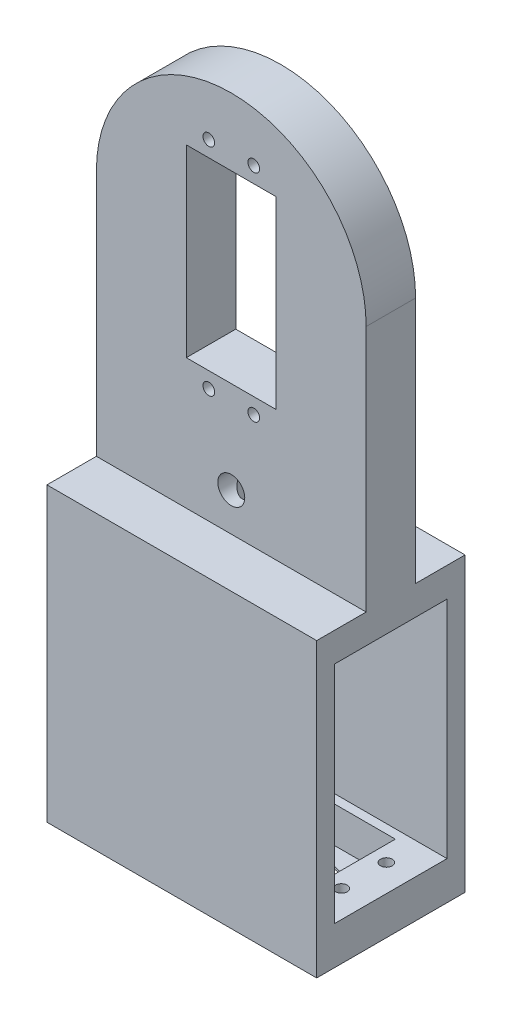
ISO-10303-21;
HEADER;
FILE_DESCRIPTION(('STEP AP214'),'2;1');
FILE_NAME('part.step','',(''),(''),'','','');
FILE_SCHEMA(('AUTOMOTIVE_DESIGN { 1 0 10303 214 1 1 1 1 }'));
ENDSEC;
DATA;
#1=APPLICATION_CONTEXT('core data for automotive mechanical design processes');
#2=APPLICATION_PROTOCOL_DEFINITION('international standard','automotive_design',2000,#1);
#3=PRODUCT_CONTEXT('',#1,'mechanical');
#4=PRODUCT('Part','Part','',(#3));
#5=PRODUCT_RELATED_PRODUCT_CATEGORY('part','',(#4));
#6=PRODUCT_DEFINITION_FORMATION('','',#4);
#7=PRODUCT_DEFINITION_CONTEXT('part definition',#1,'design');
#8=PRODUCT_DEFINITION('design','',#6,#7);
#9=PRODUCT_DEFINITION_SHAPE('','',#8);
#10=(LENGTH_UNIT() NAMED_UNIT(*) SI_UNIT(.MILLI.,.METRE.));
#11=(NAMED_UNIT(*) PLANE_ANGLE_UNIT() SI_UNIT($,.RADIAN.));
#12=(NAMED_UNIT(*) SI_UNIT($,.STERADIAN.) SOLID_ANGLE_UNIT());
#13=UNCERTAINTY_MEASURE_WITH_UNIT(LENGTH_MEASURE(1.E-05),#10,'distance_accuracy_value','');
#14=(GEOMETRIC_REPRESENTATION_CONTEXT(3) GLOBAL_UNCERTAINTY_ASSIGNED_CONTEXT((#13)) GLOBAL_UNIT_ASSIGNED_CONTEXT((#10,
#11,#12)) REPRESENTATION_CONTEXT('',''));
#15=CARTESIAN_POINT('',(0.,0.,0.));
#16=DIRECTION('',(0.,0.,1.));
#17=DIRECTION('',(1.,0.,0.));
#18=AXIS2_PLACEMENT_3D('',#15,#16,#17);
#19=CARTESIAN_POINT('',(30.,-106.,-6.99999999999999));
#20=DIRECTION('',(0.,-1.,0.));
#21=DIRECTION('',(1.,0.,0.));
#22=AXIS2_PLACEMENT_3D('',#19,#20,#21);
#23=PLANE('',#22);
#24=CARTESIAN_POINT('',(-24.,-106.,10.5));
#25=DIRECTION('',(0.,1.,0.));
#26=DIRECTION('',(-1.,0.,0.));
#27=AXIS2_PLACEMENT_3D('',#24,#25,#26);
#28=CIRCLE('',#27,1.3);
#29=CARTESIAN_POINT('',(-25.3,-106.,10.5));
#30=VERTEX_POINT('',#29);
#31=EDGE_CURVE('E208',#30,#30,#28,.T.);
#32=ORIENTED_EDGE('',*,*,#31,.F.);
#33=EDGE_LOOP('',(#32));
#34=FACE_BOUND('',#33,.T.);
#35=CARTESIAN_POINT('',(-24.,-106.,0.5));
#36=DIRECTION('',(0.,1.,0.));
#37=DIRECTION('',(-1.,0.,0.));
#38=AXIS2_PLACEMENT_3D('',#35,#36,#37);
#39=CIRCLE('',#38,1.3);
#40=CARTESIAN_POINT('',(-25.3,-106.,0.5));
#41=VERTEX_POINT('',#40);
#42=EDGE_CURVE('E211',#41,#41,#39,.T.);
#43=ORIENTED_EDGE('',*,*,#42,.F.);
#44=EDGE_LOOP('',(#43));
#45=FACE_BOUND('',#44,.T.);
#46=DIRECTION('',(0.,0.,1.));
#47=VECTOR('',#46,1.);
#48=CARTESIAN_POINT('',(-30.,-106.,-6.99999999999999));
#49=LINE('',#48,#47);
#50=CARTESIAN_POINT('',(-30.,-106.,-6.99999999999999));
#51=VERTEX_POINT('',#50);
#52=CARTESIAN_POINT('',(-30.,-106.,18.));
#53=VERTEX_POINT('',#52);
#54=EDGE_CURVE('E262',#51,#53,#49,.T.);
#55=ORIENTED_EDGE('',*,*,#54,.T.);
#56=DIRECTION('',(-1.,0.,0.));
#57=VECTOR('',#56,1.);
#58=CARTESIAN_POINT('',(30.,-106.,18.));
#59=LINE('',#58,#57);
#60=CARTESIAN_POINT('',(30.,-106.,18.));
#61=VERTEX_POINT('',#60);
#62=EDGE_CURVE('E275',#61,#53,#59,.T.);
#63=ORIENTED_EDGE('',*,*,#62,.F.);
#64=DIRECTION('',(0.,0.,1.));
#65=VECTOR('',#64,1.);
#66=CARTESIAN_POINT('',(30.,-106.,-6.99999999999999));
#67=LINE('',#66,#65);
#68=CARTESIAN_POINT('',(30.,-106.,-6.99999999999999));
#69=VERTEX_POINT('',#68);
#70=EDGE_CURVE('E250',#69,#61,#67,.T.);
#71=ORIENTED_EDGE('',*,*,#70,.F.);
#72=DIRECTION('',(-1.,0.,0.));
#73=VECTOR('',#72,1.);
#74=CARTESIAN_POINT('',(30.,-106.,-6.99999999999999));
#75=LINE('',#74,#73);
#76=EDGE_CURVE('E260',#69,#51,#75,.T.);
#77=ORIENTED_EDGE('',*,*,#76,.T.);
#78=EDGE_LOOP('',(#55,#63,#71,#77));
#79=FACE_BOUND('',#78,.T.);
#80=DIRECTION('',(0.,0.,-1.));
#81=VECTOR('',#80,1.);
#82=CARTESIAN_POINT('',(-20.5,-106.,0.));
#83=LINE('',#82,#81);
#84=CARTESIAN_POINT('',(-20.5,-106.,16.));
#85=VERTEX_POINT('',#84);
#86=CARTESIAN_POINT('',(-20.5,-106.,-5.));
#87=VERTEX_POINT('',#86);
#88=EDGE_CURVE('E65',#85,#87,#83,.T.);
#89=ORIENTED_EDGE('',*,*,#88,.T.);
#90=DIRECTION('',(-1.,0.,0.));
#91=VECTOR('',#90,1.);
#92=CARTESIAN_POINT('',(0.,-106.,-5.));
#93=LINE('',#92,#91);
#94=CARTESIAN_POINT('',(20.5,-106.,-5.));
#95=VERTEX_POINT('',#94);
#96=EDGE_CURVE('E220',#95,#87,#93,.T.);
#97=ORIENTED_EDGE('',*,*,#96,.F.);
#98=DIRECTION('',(0.,0.,-1.));
#99=VECTOR('',#98,1.);
#100=CARTESIAN_POINT('',(20.5,-106.,0.));
#101=LINE('',#100,#99);
#102=CARTESIAN_POINT('',(20.5,-106.,16.));
#103=VERTEX_POINT('',#102);
#104=EDGE_CURVE('E234',#103,#95,#101,.T.);
#105=ORIENTED_EDGE('',*,*,#104,.F.);
#106=DIRECTION('',(-1.,0.,0.));
#107=VECTOR('',#106,1.);
#108=CARTESIAN_POINT('',(0.,-106.,16.));
#109=LINE('',#108,#107);
#110=EDGE_CURVE('E230',#103,#85,#109,.T.);
#111=ORIENTED_EDGE('',*,*,#110,.T.);
#112=EDGE_LOOP('',(#89,#97,#105,#111));
#113=FACE_BOUND('',#112,.T.);
#114=CARTESIAN_POINT('',(24.,-106.,10.5));
#115=DIRECTION('',(0.,1.,0.));
#116=DIRECTION('',(-1.,0.,0.));
#117=AXIS2_PLACEMENT_3D('',#114,#115,#116);
#118=CIRCLE('',#117,1.3);
#119=CARTESIAN_POINT('',(22.7,-106.,10.5));
#120=VERTEX_POINT('',#119);
#121=EDGE_CURVE('E204',#120,#120,#118,.F.);
#122=ORIENTED_EDGE('',*,*,#121,.T.);
#123=EDGE_LOOP('',(#122));
#124=FACE_BOUND('',#123,.T.);
#125=CARTESIAN_POINT('',(24.,-106.,0.5));
#126=DIRECTION('',(0.,1.,0.));
#127=DIRECTION('',(-1.,0.,0.));
#128=AXIS2_PLACEMENT_3D('',#125,#126,#127);
#129=CIRCLE('',#128,1.3);
#130=CARTESIAN_POINT('',(22.7,-106.,0.5));
#131=VERTEX_POINT('',#130);
#132=EDGE_CURVE('E207',#131,#131,#129,.F.);
#133=ORIENTED_EDGE('',*,*,#132,.T.);
#134=EDGE_LOOP('',(#133));
#135=FACE_BOUND('',#134,.T.);
#136=ADVANCED_FACE('F40',(#34,#45,#79,#113,#124,#135),#23,.F.);
#137=CARTESIAN_POINT('',(-30.,-114.5,11.));
#138=DIRECTION('',(0.,1.,0.));
#139=DIRECTION('',(-1.,0.,0.));
#140=AXIS2_PLACEMENT_3D('',#137,#138,#139);
#141=PLANE('',#140);
#142=CARTESIAN_POINT('',(10.2,-114.5,5.5));
#143=DIRECTION('',(0.,-1.,0.));
#144=DIRECTION('',(1.,0.,0.));
#145=AXIS2_PLACEMENT_3D('',#142,#143,#144);
#146=CIRCLE('',#145,6.5);
#147=CARTESIAN_POINT('',(16.7,-114.5,5.5));
#148=VERTEX_POINT('',#147);
#149=EDGE_CURVE('E201',#148,#148,#146,.T.);
#150=ORIENTED_EDGE('',*,*,#149,.F.);
#151=EDGE_LOOP('',(#150));
#152=FACE_BOUND('',#151,.T.);
#153=CARTESIAN_POINT('',(-24.,-114.5,10.5));
#154=DIRECTION('',(0.,1.,0.));
#155=DIRECTION('',(-1.,0.,0.));
#156=AXIS2_PLACEMENT_3D('',#153,#154,#155);
#157=CIRCLE('',#156,1.3);
#158=CARTESIAN_POINT('',(-25.3,-114.5,10.5));
#159=VERTEX_POINT('',#158);
#160=EDGE_CURVE('E231',#159,#159,#157,.T.);
#161=ORIENTED_EDGE('',*,*,#160,.T.);
#162=EDGE_LOOP('',(#161));
#163=FACE_BOUND('',#162,.T.);
#164=CARTESIAN_POINT('',(-24.,-114.5,0.5));
#165=DIRECTION('',(0.,1.,0.));
#166=DIRECTION('',(-1.,0.,0.));
#167=AXIS2_PLACEMENT_3D('',#164,#165,#166);
#168=CIRCLE('',#167,1.3);
#169=CARTESIAN_POINT('',(-25.3,-114.5,0.5));
#170=VERTEX_POINT('',#169);
#171=EDGE_CURVE('E216',#170,#170,#168,.T.);
#172=ORIENTED_EDGE('',*,*,#171,.T.);
#173=EDGE_LOOP('',(#172));
#174=FACE_BOUND('',#173,.T.);
#175=DIRECTION('',(0.,0.,-1.));
#176=VECTOR('',#175,1.);
#177=CARTESIAN_POINT('',(-30.,-114.5,11.));
#178=LINE('',#177,#176);
#179=CARTESIAN_POINT('',(-30.,-114.5,22.));
#180=VERTEX_POINT('',#179);
#181=CARTESIAN_POINT('',(-30.,-114.5,-11.));
#182=VERTEX_POINT('',#181);
#183=EDGE_CURVE('E381',#180,#182,#178,.T.);
#184=ORIENTED_EDGE('',*,*,#183,.T.);
#185=DIRECTION('',(1.,0.,0.));
#186=VECTOR('',#185,1.);
#187=CARTESIAN_POINT('',(-30.,-114.5,-11.));
#188=LINE('',#187,#186);
#189=CARTESIAN_POINT('',(30.,-114.5,-11.));
#190=VERTEX_POINT('',#189);
#191=EDGE_CURVE('E293',#182,#190,#188,.T.);
#192=ORIENTED_EDGE('',*,*,#191,.T.);
#193=DIRECTION('',(0.,0.,-1.));
#194=VECTOR('',#193,1.);
#195=CARTESIAN_POINT('',(30.,-114.5,11.));
#196=LINE('',#195,#194);
#197=CARTESIAN_POINT('',(30.,-114.5,22.));
#198=VERTEX_POINT('',#197);
#199=EDGE_CURVE('E376',#198,#190,#196,.T.);
#200=ORIENTED_EDGE('',*,*,#199,.F.);
#201=DIRECTION('',(1.,0.,0.));
#202=VECTOR('',#201,1.);
#203=CARTESIAN_POINT('',(-30.,-114.5,22.));
#204=LINE('',#203,#202);
#205=EDGE_CURVE('E281',#180,#198,#204,.T.);
#206=ORIENTED_EDGE('',*,*,#205,.F.);
#207=EDGE_LOOP('',(#184,#192,#200,#206));
#208=FACE_BOUND('',#207,.T.);
#209=CARTESIAN_POINT('',(24.,-114.5,10.5));
#210=DIRECTION('',(0.,1.,0.));
#211=DIRECTION('',(-1.,0.,0.));
#212=AXIS2_PLACEMENT_3D('',#209,#210,#211);
#213=CIRCLE('',#212,1.3);
#214=CARTESIAN_POINT('',(22.7,-114.5,10.5));
#215=VERTEX_POINT('',#214);
#216=EDGE_CURVE('E392',#215,#215,#213,.F.);
#217=ORIENTED_EDGE('',*,*,#216,.F.);
#218=EDGE_LOOP('',(#217));
#219=FACE_BOUND('',#218,.T.);
#220=CARTESIAN_POINT('',(24.,-114.5,0.5));
#221=DIRECTION('',(0.,1.,0.));
#222=DIRECTION('',(-1.,0.,0.));
#223=AXIS2_PLACEMENT_3D('',#220,#221,#222);
#224=CIRCLE('',#223,1.3);
#225=CARTESIAN_POINT('',(22.7,-114.5,0.5));
#226=VERTEX_POINT('',#225);
#227=EDGE_CURVE('E395',#226,#226,#224,.F.);
#228=ORIENTED_EDGE('',*,*,#227,.F.);
#229=EDGE_LOOP('',(#228));
#230=FACE_BOUND('',#229,.T.);
#231=ADVANCED_FACE('F400',(#152,#163,#174,#208,#219,#230),#141,.F.);
#232=CARTESIAN_POINT('',(0.,5.49999999999999,11.));
#233=DIRECTION('',(0.,0.,-1.));
#234=DIRECTION('',(-1.,0.,0.));
#235=AXIS2_PLACEMENT_3D('',#232,#233,#234);
#236=CYLINDRICAL_SURFACE('',#235,30.);
#237=DIRECTION('',(0.,0.,-1.));
#238=VECTOR('',#237,1.);
#239=CARTESIAN_POINT('',(-30.,5.49999999999998,11.));
#240=LINE('',#239,#238);
#241=CARTESIAN_POINT('',(-30.,5.49999999999998,11.));
#242=VERTEX_POINT('',#241);
#243=CARTESIAN_POINT('',(-30.,5.49999999999998,0.));
#244=VERTEX_POINT('',#243);
#245=EDGE_CURVE('E383',#242,#244,#240,.T.);
#246=ORIENTED_EDGE('',*,*,#245,.F.);
#247=CARTESIAN_POINT('',(0.,5.49999999999999,11.));
#248=DIRECTION('',(0.,0.,1.));
#249=DIRECTION('',(1.,0.,0.));
#250=AXIS2_PLACEMENT_3D('',#247,#248,#249);
#251=CIRCLE('',#250,30.);
#252=CARTESIAN_POINT('',(30.,5.49999999999999,11.));
#253=VERTEX_POINT('',#252);
#254=EDGE_CURVE('E50',#253,#242,#251,.T.);
#255=ORIENTED_EDGE('',*,*,#254,.F.);
#256=DIRECTION('',(0.,0.,-1.));
#257=VECTOR('',#256,1.);
#258=CARTESIAN_POINT('',(30.,5.49999999999999,11.));
#259=LINE('',#258,#257);
#260=CARTESIAN_POINT('',(30.,5.49999999999999,0.));
#261=VERTEX_POINT('',#260);
#262=EDGE_CURVE('E386',#261,#253,#259,.F.);
#263=ORIENTED_EDGE('',*,*,#262,.F.);
#264=CARTESIAN_POINT('',(0.,5.49999999999999,0.));
#265=DIRECTION('',(0.,0.,1.));
#266=DIRECTION('',(1.,0.,0.));
#267=AXIS2_PLACEMENT_3D('',#264,#265,#266);
#268=CIRCLE('',#267,30.);
#269=EDGE_CURVE('E11',#244,#261,#268,.F.);
#270=ORIENTED_EDGE('',*,*,#269,.F.);
#271=EDGE_LOOP('',(#246,#255,#263,#270));
#272=FACE_BOUND('',#271,.T.);
#273=ADVANCED_FACE('F43',(#272),#236,.T.);
#274=CARTESIAN_POINT('',(0.,0.,11.));
#275=DIRECTION('',(0.,0.,1.));
#276=DIRECTION('',(1.,0.,0.));
#277=AXIS2_PLACEMENT_3D('',#274,#275,#276);
#278=PLANE('',#277);
#279=CARTESIAN_POINT('',(0.,-41.,11.));
#280=DIRECTION('',(0.,0.,1.));
#281=DIRECTION('',(1.,0.,0.));
#282=AXIS2_PLACEMENT_3D('',#279,#280,#281);
#283=CIRCLE('',#282,3.);
#284=CARTESIAN_POINT('',(3.00000000000001,-41.,11.));
#285=VERTEX_POINT('',#284);
#286=EDGE_CURVE('E188',#285,#285,#283,.T.);
#287=ORIENTED_EDGE('',*,*,#286,.F.);
#288=EDGE_LOOP('',(#287));
#289=FACE_BOUND('',#288,.T.);
#290=DIRECTION('',(-1.,0.,0.));
#291=VECTOR('',#290,1.);
#292=CARTESIAN_POINT('',(0.,-49.5,11.));
#293=LINE('',#292,#291);
#294=CARTESIAN_POINT('',(30.,-49.5,11.));
#295=VERTEX_POINT('',#294);
#296=CARTESIAN_POINT('',(-30.,-49.5,11.));
#297=VERTEX_POINT('',#296);
#298=EDGE_CURVE('E312',#295,#297,#293,.T.);
#299=ORIENTED_EDGE('',*,*,#298,.F.);
#300=DIRECTION('',(0.,1.,0.));
#301=VECTOR('',#300,1.);
#302=CARTESIAN_POINT('',(30.,35.5,11.));
#303=LINE('',#302,#301);
#304=EDGE_CURVE('E373',#295,#253,#303,.T.);
#305=ORIENTED_EDGE('',*,*,#304,.T.);
#306=ORIENTED_EDGE('',*,*,#254,.T.);
#307=DIRECTION('',(0.,-1.,0.));
#308=VECTOR('',#307,1.);
#309=CARTESIAN_POINT('',(-30.,35.5,11.));
#310=LINE('',#309,#308);
#311=EDGE_CURVE('E371',#242,#297,#310,.T.);
#312=ORIENTED_EDGE('',*,*,#311,.T.);
#313=EDGE_LOOP('',(#299,#305,#306,#312));
#314=FACE_BOUND('',#313,.T.);
#315=CARTESIAN_POINT('',(-5.,-24.,11.));
#316=DIRECTION('',(0.,0.,1.));
#317=DIRECTION('',(-1.,0.,0.));
#318=AXIS2_PLACEMENT_3D('',#315,#316,#317);
#319=CIRCLE('',#318,1.3);
#320=CARTESIAN_POINT('',(-6.3,-24.,11.));
#321=VERTEX_POINT('',#320);
#322=EDGE_CURVE('E329',#321,#321,#319,.T.);
#323=ORIENTED_EDGE('',*,*,#322,.F.);
#324=EDGE_LOOP('',(#323));
#325=FACE_BOUND('',#324,.T.);
#326=CARTESIAN_POINT('',(5.,-24.,11.));
#327=DIRECTION('',(0.,0.,1.));
#328=DIRECTION('',(-1.,0.,0.));
#329=AXIS2_PLACEMENT_3D('',#326,#327,#328);
#330=CIRCLE('',#329,1.3);
#331=CARTESIAN_POINT('',(3.7,-24.,11.));
#332=VERTEX_POINT('',#331);
#333=EDGE_CURVE('E323',#332,#332,#330,.T.);
#334=ORIENTED_EDGE('',*,*,#333,.F.);
#335=EDGE_LOOP('',(#334));
#336=FACE_BOUND('',#335,.T.);
#337=CARTESIAN_POINT('',(5.,24.,11.));
#338=DIRECTION('',(0.,0.,1.));
#339=DIRECTION('',(1.,0.,0.));
#340=AXIS2_PLACEMENT_3D('',#337,#338,#339);
#341=CIRCLE('',#340,1.3);
#342=CARTESIAN_POINT('',(6.3,24.,11.));
#343=VERTEX_POINT('',#342);
#344=EDGE_CURVE('E316',#343,#343,#341,.T.);
#345=ORIENTED_EDGE('',*,*,#344,.F.);
#346=EDGE_LOOP('',(#345));
#347=FACE_BOUND('',#346,.T.);
#348=CARTESIAN_POINT('',(-5.,24.,11.));
#349=DIRECTION('',(0.,0.,1.));
#350=DIRECTION('',(1.,0.,0.));
#351=AXIS2_PLACEMENT_3D('',#348,#349,#350);
#352=CIRCLE('',#351,1.3);
#353=CARTESIAN_POINT('',(-3.7,24.,11.));
#354=VERTEX_POINT('',#353);
#355=EDGE_CURVE('E319',#354,#354,#352,.T.);
#356=ORIENTED_EDGE('',*,*,#355,.F.);
#357=EDGE_LOOP('',(#356));
#358=FACE_BOUND('',#357,.T.);
#359=DIRECTION('',(-1.,0.,0.));
#360=VECTOR('',#359,1.);
#361=CARTESIAN_POINT('',(-10.,20.5,11.));
#362=LINE('',#361,#360);
#363=CARTESIAN_POINT('',(10.,20.5,11.));
#364=VERTEX_POINT('',#363);
#365=CARTESIAN_POINT('',(-10.,20.5,11.));
#366=VERTEX_POINT('',#365);
#367=EDGE_CURVE('E342',#364,#366,#362,.T.);
#368=ORIENTED_EDGE('',*,*,#367,.F.);
#369=DIRECTION('',(0.,1.,0.));
#370=VECTOR('',#369,1.);
#371=CARTESIAN_POINT('',(10.,-20.5,11.));
#372=LINE('',#371,#370);
#373=CARTESIAN_POINT('',(10.,-20.5,11.));
#374=VERTEX_POINT('',#373);
#375=EDGE_CURVE('E340',#374,#364,#372,.T.);
#376=ORIENTED_EDGE('',*,*,#375,.F.);
#377=DIRECTION('',(1.,0.,0.));
#378=VECTOR('',#377,1.);
#379=CARTESIAN_POINT('',(-10.,-20.5,11.));
#380=LINE('',#379,#378);
#381=CARTESIAN_POINT('',(-10.,-20.5,11.));
#382=VERTEX_POINT('',#381);
#383=EDGE_CURVE('E348',#382,#374,#380,.T.);
#384=ORIENTED_EDGE('',*,*,#383,.F.);
#385=DIRECTION('',(0.,-1.,0.));
#386=VECTOR('',#385,1.);
#387=CARTESIAN_POINT('',(-10.,-20.5,11.));
#388=LINE('',#387,#386);
#389=EDGE_CURVE('E345',#366,#382,#388,.T.);
#390=ORIENTED_EDGE('',*,*,#389,.F.);
#391=EDGE_LOOP('',(#368,#376,#384,#390));
#392=FACE_BOUND('',#391,.T.);
#393=ADVANCED_FACE('F484',(#289,#314,#325,#336,#347,#358,#392),#278,.T.);
#394=CARTESIAN_POINT('',(0.,0.,0.));
#395=DIRECTION('',(0.,0.,1.));
#396=DIRECTION('',(1.,0.,0.));
#397=AXIS2_PLACEMENT_3D('',#394,#395,#396);
#398=PLANE('',#397);
#399=CARTESIAN_POINT('',(0.,-41.,0.));
#400=DIRECTION('',(0.,0.,1.));
#401=DIRECTION('',(1.,0.,0.));
#402=AXIS2_PLACEMENT_3D('',#399,#400,#401);
#403=CIRCLE('',#402,3.);
#404=CARTESIAN_POINT('',(3.00000000000001,-41.,0.));
#405=VERTEX_POINT('',#404);
#406=EDGE_CURVE('E192',#405,#405,#403,.T.);
#407=ORIENTED_EDGE('',*,*,#406,.T.);
#408=EDGE_LOOP('',(#407));
#409=FACE_BOUND('',#408,.T.);
#410=CARTESIAN_POINT('',(-5.,-24.,0.));
#411=DIRECTION('',(0.,0.,1.));
#412=DIRECTION('',(-1.,0.,0.));
#413=AXIS2_PLACEMENT_3D('',#410,#411,#412);
#414=CIRCLE('',#413,1.3);
#415=CARTESIAN_POINT('',(-6.3,-24.,0.));
#416=VERTEX_POINT('',#415);
#417=EDGE_CURVE('E315',#416,#416,#414,.T.);
#418=ORIENTED_EDGE('',*,*,#417,.T.);
#419=EDGE_LOOP('',(#418));
#420=FACE_BOUND('',#419,.T.);
#421=CARTESIAN_POINT('',(5.,-24.,0.));
#422=DIRECTION('',(0.,0.,1.));
#423=DIRECTION('',(-1.,0.,0.));
#424=AXIS2_PLACEMENT_3D('',#421,#422,#423);
#425=CIRCLE('',#424,1.3);
#426=CARTESIAN_POINT('',(3.7,-24.,0.));
#427=VERTEX_POINT('',#426);
#428=EDGE_CURVE('E326',#427,#427,#425,.T.);
#429=ORIENTED_EDGE('',*,*,#428,.T.);
#430=EDGE_LOOP('',(#429));
#431=FACE_BOUND('',#430,.T.);
#432=CARTESIAN_POINT('',(5.,24.,0.));
#433=DIRECTION('',(0.,0.,1.));
#434=DIRECTION('',(1.,0.,0.));
#435=AXIS2_PLACEMENT_3D('',#432,#433,#434);
#436=CIRCLE('',#435,1.3);
#437=CARTESIAN_POINT('',(6.3,24.,0.));
#438=VERTEX_POINT('',#437);
#439=EDGE_CURVE('E320',#438,#438,#436,.T.);
#440=ORIENTED_EDGE('',*,*,#439,.T.);
#441=EDGE_LOOP('',(#440));
#442=FACE_BOUND('',#441,.T.);
#443=CARTESIAN_POINT('',(-5.,24.,0.));
#444=DIRECTION('',(0.,0.,1.));
#445=DIRECTION('',(1.,0.,0.));
#446=AXIS2_PLACEMENT_3D('',#443,#444,#445);
#447=CIRCLE('',#446,1.3);
#448=CARTESIAN_POINT('',(-3.7,24.,0.));
#449=VERTEX_POINT('',#448);
#450=EDGE_CURVE('E334',#449,#449,#447,.T.);
#451=ORIENTED_EDGE('',*,*,#450,.T.);
#452=EDGE_LOOP('',(#451));
#453=FACE_BOUND('',#452,.T.);
#454=DIRECTION('',(0.,1.,0.));
#455=VECTOR('',#454,1.);
#456=CARTESIAN_POINT('',(30.,35.5,0.));
#457=LINE('',#456,#455);
#458=CARTESIAN_POINT('',(30.,-49.5,0.));
#459=VERTEX_POINT('',#458);
#460=EDGE_CURVE('E374',#459,#261,#457,.T.);
#461=ORIENTED_EDGE('',*,*,#460,.F.);
#462=DIRECTION('',(-1.,0.,0.));
#463=VECTOR('',#462,1.);
#464=CARTESIAN_POINT('',(0.,-49.5,0.));
#465=LINE('',#464,#463);
#466=CARTESIAN_POINT('',(-30.,-49.5,0.));
#467=VERTEX_POINT('',#466);
#468=EDGE_CURVE('E305',#459,#467,#465,.T.);
#469=ORIENTED_EDGE('',*,*,#468,.T.);
#470=DIRECTION('',(0.,-1.,0.));
#471=VECTOR('',#470,1.);
#472=CARTESIAN_POINT('',(-30.,35.5,0.));
#473=LINE('',#472,#471);
#474=EDGE_CURVE('E370',#244,#467,#473,.T.);
#475=ORIENTED_EDGE('',*,*,#474,.F.);
#476=ORIENTED_EDGE('',*,*,#269,.T.);
#477=EDGE_LOOP('',(#461,#469,#475,#476));
#478=FACE_BOUND('',#477,.T.);
#479=DIRECTION('',(0.,1.,0.));
#480=VECTOR('',#479,1.);
#481=CARTESIAN_POINT('',(10.,-20.5,0.));
#482=LINE('',#481,#480);
#483=CARTESIAN_POINT('',(10.,-20.5,0.));
#484=VERTEX_POINT('',#483);
#485=CARTESIAN_POINT('',(10.,20.5,0.));
#486=VERTEX_POINT('',#485);
#487=EDGE_CURVE('E337',#484,#486,#482,.T.);
#488=ORIENTED_EDGE('',*,*,#487,.T.);
#489=DIRECTION('',(-1.,0.,0.));
#490=VECTOR('',#489,1.);
#491=CARTESIAN_POINT('',(-10.,20.5,0.));
#492=LINE('',#491,#490);
#493=CARTESIAN_POINT('',(-10.,20.5,0.));
#494=VERTEX_POINT('',#493);
#495=EDGE_CURVE('E353',#486,#494,#492,.T.);
#496=ORIENTED_EDGE('',*,*,#495,.T.);
#497=DIRECTION('',(0.,-1.,0.));
#498=VECTOR('',#497,1.);
#499=CARTESIAN_POINT('',(-10.,-20.5,0.));
#500=LINE('',#499,#498);
#501=CARTESIAN_POINT('',(-10.,-20.5,0.));
#502=VERTEX_POINT('',#501);
#503=EDGE_CURVE('E356',#494,#502,#500,.T.);
#504=ORIENTED_EDGE('',*,*,#503,.T.);
#505=DIRECTION('',(1.,0.,0.));
#506=VECTOR('',#505,1.);
#507=CARTESIAN_POINT('',(-10.,-20.5,0.));
#508=LINE('',#507,#506);
#509=EDGE_CURVE('E343',#502,#484,#508,.T.);
#510=ORIENTED_EDGE('',*,*,#509,.T.);
#511=EDGE_LOOP('',(#488,#496,#504,#510));
#512=FACE_BOUND('',#511,.T.);
#513=ADVANCED_FACE('F487',(#409,#420,#431,#442,#453,#478,#512),#398,.F.);
#514=CARTESIAN_POINT('',(-30.,35.5,11.));
#515=DIRECTION('',(1.,0.,0.));
#516=DIRECTION('',(0.,1.,0.));
#517=AXIS2_PLACEMENT_3D('',#514,#515,#516);
#518=PLANE('',#517);
#519=ORIENTED_EDGE('',*,*,#54,.F.);
#520=DIRECTION('',(0.,-1.,0.));
#521=VECTOR('',#520,1.);
#522=CARTESIAN_POINT('',(-30.,-56.,-7.));
#523=LINE('',#522,#521);
#524=CARTESIAN_POINT('',(-30.,-56.,-7.));
#525=VERTEX_POINT('',#524);
#526=EDGE_CURVE('E241',#525,#51,#523,.T.);
#527=ORIENTED_EDGE('',*,*,#526,.F.);
#528=DIRECTION('',(0.,0.,-1.));
#529=VECTOR('',#528,1.);
#530=CARTESIAN_POINT('',(-30.,-56.,-7.));
#531=LINE('',#530,#529);
#532=CARTESIAN_POINT('',(-30.,-56.,18.));
#533=VERTEX_POINT('',#532);
#534=EDGE_CURVE('E251',#533,#525,#531,.T.);
#535=ORIENTED_EDGE('',*,*,#534,.F.);
#536=DIRECTION('',(0.,1.,0.));
#537=VECTOR('',#536,1.);
#538=CARTESIAN_POINT('',(-30.,-56.,18.));
#539=LINE('',#538,#537);
#540=EDGE_CURVE('E265',#53,#533,#539,.T.);
#541=ORIENTED_EDGE('',*,*,#540,.F.);
#542=EDGE_LOOP('',(#519,#527,#535,#541));
#543=FACE_BOUND('',#542,.T.);
#544=ORIENTED_EDGE('',*,*,#474,.T.);
#545=DIRECTION('',(0.,0.,1.));
#546=VECTOR('',#545,1.);
#547=CARTESIAN_POINT('',(-30.,-49.5,-11.));
#548=LINE('',#547,#546);
#549=CARTESIAN_POINT('',(-30.,-49.5,-11.));
#550=VERTEX_POINT('',#549);
#551=EDGE_CURVE('E303',#550,#467,#548,.T.);
#552=ORIENTED_EDGE('',*,*,#551,.F.);
#553=DIRECTION('',(0.,-1.,0.));
#554=VECTOR('',#553,1.);
#555=CARTESIAN_POINT('',(-30.,-114.5,-11.));
#556=LINE('',#555,#554);
#557=EDGE_CURVE('E290',#550,#182,#556,.T.);
#558=ORIENTED_EDGE('',*,*,#557,.T.);
#559=ORIENTED_EDGE('',*,*,#183,.F.);
#560=DIRECTION('',(0.,-1.,0.));
#561=VECTOR('',#560,1.);
#562=CARTESIAN_POINT('',(-30.,-114.5,22.));
#563=LINE('',#562,#561);
#564=CARTESIAN_POINT('',(-30.,-49.5,22.));
#565=VERTEX_POINT('',#564);
#566=EDGE_CURVE('E272',#565,#180,#563,.T.);
#567=ORIENTED_EDGE('',*,*,#566,.F.);
#568=EDGE_CURVE('E306',#297,#565,#548,.T.);
#569=ORIENTED_EDGE('',*,*,#568,.F.);
#570=ORIENTED_EDGE('',*,*,#311,.F.);
#571=ORIENTED_EDGE('',*,*,#245,.T.);
#572=EDGE_LOOP('',(#544,#552,#558,#559,#567,#569,#570,#571));
#573=FACE_BOUND('',#572,.T.);
#574=ADVANCED_FACE('F491',(#543,#573),#518,.F.);
#575=CARTESIAN_POINT('',(30.,35.5,11.));
#576=DIRECTION('',(-1.,0.,0.));
#577=DIRECTION('',(0.,-1.,0.));
#578=AXIS2_PLACEMENT_3D('',#575,#576,#577);
#579=PLANE('',#578);
#580=DIRECTION('',(0.,0.,-1.));
#581=VECTOR('',#580,1.);
#582=CARTESIAN_POINT('',(30.,-56.,-7.));
#583=LINE('',#582,#581);
#584=CARTESIAN_POINT('',(30.,-56.,18.));
#585=VERTEX_POINT('',#584);
#586=CARTESIAN_POINT('',(30.,-56.,-7.));
#587=VERTEX_POINT('',#586);
#588=EDGE_CURVE('E257',#585,#587,#583,.T.);
#589=ORIENTED_EDGE('',*,*,#588,.T.);
#590=DIRECTION('',(0.,-1.,0.));
#591=VECTOR('',#590,1.);
#592=CARTESIAN_POINT('',(30.,-56.,-7.));
#593=LINE('',#592,#591);
#594=EDGE_CURVE('E247',#587,#69,#593,.T.);
#595=ORIENTED_EDGE('',*,*,#594,.T.);
#596=ORIENTED_EDGE('',*,*,#70,.T.);
#597=DIRECTION('',(0.,1.,0.));
#598=VECTOR('',#597,1.);
#599=CARTESIAN_POINT('',(30.,-56.,18.));
#600=LINE('',#599,#598);
#601=EDGE_CURVE('E254',#61,#585,#600,.T.);
#602=ORIENTED_EDGE('',*,*,#601,.T.);
#603=EDGE_LOOP('',(#589,#595,#596,#602));
#604=FACE_BOUND('',#603,.T.);
#605=ORIENTED_EDGE('',*,*,#304,.F.);
#606=DIRECTION('',(0.,0.,1.));
#607=VECTOR('',#606,1.);
#608=CARTESIAN_POINT('',(30.,-49.5,-11.));
#609=LINE('',#608,#607);
#610=CARTESIAN_POINT('',(30.,-49.5,22.));
#611=VERTEX_POINT('',#610);
#612=EDGE_CURVE('E302',#295,#611,#609,.T.);
#613=ORIENTED_EDGE('',*,*,#612,.T.);
#614=DIRECTION('',(0.,1.,0.));
#615=VECTOR('',#614,1.);
#616=CARTESIAN_POINT('',(30.,-114.5,22.));
#617=LINE('',#616,#615);
#618=EDGE_CURVE('E284',#198,#611,#617,.T.);
#619=ORIENTED_EDGE('',*,*,#618,.F.);
#620=ORIENTED_EDGE('',*,*,#199,.T.);
#621=DIRECTION('',(0.,1.,0.));
#622=VECTOR('',#621,1.);
#623=CARTESIAN_POINT('',(30.,-114.5,-11.));
#624=LINE('',#623,#622);
#625=CARTESIAN_POINT('',(30.,-49.5,-11.));
#626=VERTEX_POINT('',#625);
#627=EDGE_CURVE('E296',#190,#626,#624,.T.);
#628=ORIENTED_EDGE('',*,*,#627,.T.);
#629=EDGE_CURVE('E307',#626,#459,#609,.T.);
#630=ORIENTED_EDGE('',*,*,#629,.T.);
#631=ORIENTED_EDGE('',*,*,#460,.T.);
#632=ORIENTED_EDGE('',*,*,#262,.T.);
#633=EDGE_LOOP('',(#605,#613,#619,#620,#628,#630,#631,#632));
#634=FACE_BOUND('',#633,.T.);
#635=ADVANCED_FACE('F482',(#604,#634),#579,.F.);
#636=CARTESIAN_POINT('',(10.,-20.5,11.));
#637=DIRECTION('',(-1.,0.,0.));
#638=DIRECTION('',(0.,0.,1.));
#639=AXIS2_PLACEMENT_3D('',#636,#637,#638);
#640=PLANE('',#639);
#641=ORIENTED_EDGE('',*,*,#487,.F.);
#642=DIRECTION('',(0.,0.,-1.));
#643=VECTOR('',#642,1.);
#644=CARTESIAN_POINT('',(10.,-20.5,11.));
#645=LINE('',#644,#643);
#646=EDGE_CURVE('E350',#374,#484,#645,.T.);
#647=ORIENTED_EDGE('',*,*,#646,.F.);
#648=ORIENTED_EDGE('',*,*,#375,.T.);
#649=DIRECTION('',(0.,0.,-1.));
#650=VECTOR('',#649,1.);
#651=CARTESIAN_POINT('',(10.,20.5,11.));
#652=LINE('',#651,#650);
#653=EDGE_CURVE('E367',#364,#486,#652,.T.);
#654=ORIENTED_EDGE('',*,*,#653,.T.);
#655=EDGE_LOOP('',(#641,#647,#648,#654));
#656=FACE_BOUND('',#655,.T.);
#657=ADVANCED_FACE('F478',(#656),#640,.T.);
#658=CARTESIAN_POINT('',(-10.,20.5,11.));
#659=DIRECTION('',(0.,-1.,0.));
#660=DIRECTION('',(0.,0.,-1.));
#661=AXIS2_PLACEMENT_3D('',#658,#659,#660);
#662=PLANE('',#661);
#663=ORIENTED_EDGE('',*,*,#495,.F.);
#664=ORIENTED_EDGE('',*,*,#653,.F.);
#665=ORIENTED_EDGE('',*,*,#367,.T.);
#666=DIRECTION('',(0.,0.,-1.));
#667=VECTOR('',#666,1.);
#668=CARTESIAN_POINT('',(-10.,20.5,11.));
#669=LINE('',#668,#667);
#670=EDGE_CURVE('E365',#366,#494,#669,.T.);
#671=ORIENTED_EDGE('',*,*,#670,.T.);
#672=EDGE_LOOP('',(#663,#664,#665,#671));
#673=FACE_BOUND('',#672,.T.);
#674=ADVANCED_FACE('F474',(#673),#662,.T.);
#675=CARTESIAN_POINT('',(-10.,-20.5,11.));
#676=DIRECTION('',(1.,0.,0.));
#677=DIRECTION('',(0.,0.,-1.));
#678=AXIS2_PLACEMENT_3D('',#675,#676,#677);
#679=PLANE('',#678);
#680=ORIENTED_EDGE('',*,*,#503,.F.);
#681=ORIENTED_EDGE('',*,*,#670,.F.);
#682=ORIENTED_EDGE('',*,*,#389,.T.);
#683=DIRECTION('',(0.,0.,-1.));
#684=VECTOR('',#683,1.);
#685=CARTESIAN_POINT('',(-10.,-20.5,11.));
#686=LINE('',#685,#684);
#687=EDGE_CURVE('E363',#382,#502,#686,.T.);
#688=ORIENTED_EDGE('',*,*,#687,.T.);
#689=EDGE_LOOP('',(#680,#681,#682,#688));
#690=FACE_BOUND('',#689,.T.);
#691=ADVANCED_FACE('F470',(#690),#679,.T.);
#692=CARTESIAN_POINT('',(-10.,-20.5,11.));
#693=DIRECTION('',(0.,1.,0.));
#694=DIRECTION('',(0.,0.,1.));
#695=AXIS2_PLACEMENT_3D('',#692,#693,#694);
#696=PLANE('',#695);
#697=ORIENTED_EDGE('',*,*,#509,.F.);
#698=ORIENTED_EDGE('',*,*,#687,.F.);
#699=ORIENTED_EDGE('',*,*,#383,.T.);
#700=ORIENTED_EDGE('',*,*,#646,.T.);
#701=EDGE_LOOP('',(#697,#698,#699,#700));
#702=FACE_BOUND('',#701,.T.);
#703=ADVANCED_FACE('F466',(#702),#696,.T.);
#704=CARTESIAN_POINT('',(-5.,24.,0.));
#705=DIRECTION('',(0.,0.,1.));
#706=DIRECTION('',(1.,0.,0.));
#707=AXIS2_PLACEMENT_3D('',#704,#705,#706);
#708=CYLINDRICAL_SURFACE('',#707,1.3);
#709=ORIENTED_EDGE('',*,*,#450,.F.);
#710=EDGE_LOOP('',(#709));
#711=FACE_BOUND('',#710,.T.);
#712=ORIENTED_EDGE('',*,*,#355,.T.);
#713=EDGE_LOOP('',(#712));
#714=FACE_BOUND('',#713,.T.);
#715=ADVANCED_FACE('F456',(#711,#714),#708,.F.);
#716=CARTESIAN_POINT('',(5.,24.,0.));
#717=DIRECTION('',(0.,0.,1.));
#718=DIRECTION('',(1.,0.,0.));
#719=AXIS2_PLACEMENT_3D('',#716,#717,#718);
#720=CYLINDRICAL_SURFACE('',#719,1.3);
#721=ORIENTED_EDGE('',*,*,#439,.F.);
#722=EDGE_LOOP('',(#721));
#723=FACE_BOUND('',#722,.T.);
#724=ORIENTED_EDGE('',*,*,#344,.T.);
#725=EDGE_LOOP('',(#724));
#726=FACE_BOUND('',#725,.T.);
#727=ADVANCED_FACE('F452',(#723,#726),#720,.F.);
#728=CARTESIAN_POINT('',(5.,-24.,0.));
#729=DIRECTION('',(0.,0.,1.));
#730=DIRECTION('',(1.,0.,0.));
#731=AXIS2_PLACEMENT_3D('',#728,#729,#730);
#732=CYLINDRICAL_SURFACE('',#731,1.3);
#733=ORIENTED_EDGE('',*,*,#428,.F.);
#734=EDGE_LOOP('',(#733));
#735=FACE_BOUND('',#734,.T.);
#736=ORIENTED_EDGE('',*,*,#333,.T.);
#737=EDGE_LOOP('',(#736));
#738=FACE_BOUND('',#737,.T.);
#739=ADVANCED_FACE('F455',(#735,#738),#732,.F.);
#740=CARTESIAN_POINT('',(-5.,-24.,0.));
#741=DIRECTION('',(0.,0.,1.));
#742=DIRECTION('',(1.,0.,0.));
#743=AXIS2_PLACEMENT_3D('',#740,#741,#742);
#744=CYLINDRICAL_SURFACE('',#743,1.3);
#745=ORIENTED_EDGE('',*,*,#417,.F.);
#746=EDGE_LOOP('',(#745));
#747=FACE_BOUND('',#746,.T.);
#748=ORIENTED_EDGE('',*,*,#322,.T.);
#749=EDGE_LOOP('',(#748));
#750=FACE_BOUND('',#749,.T.);
#751=ADVANCED_FACE('F447',(#747,#750),#744,.F.);
#752=CARTESIAN_POINT('',(0.,0.,-11.));
#753=DIRECTION('',(0.,0.,-1.));
#754=DIRECTION('',(-1.,0.,0.));
#755=AXIS2_PLACEMENT_3D('',#752,#753,#754);
#756=PLANE('',#755);
#757=ORIENTED_EDGE('',*,*,#557,.F.);
#758=DIRECTION('',(-1.,0.,0.));
#759=VECTOR('',#758,1.);
#760=CARTESIAN_POINT('',(-30.,-49.5,-11.));
#761=LINE('',#760,#759);
#762=EDGE_CURVE('E299',#626,#550,#761,.T.);
#763=ORIENTED_EDGE('',*,*,#762,.F.);
#764=ORIENTED_EDGE('',*,*,#627,.F.);
#765=ORIENTED_EDGE('',*,*,#191,.F.);
#766=EDGE_LOOP('',(#757,#763,#764,#765));
#767=FACE_BOUND('',#766,.T.);
#768=ADVANCED_FACE('F443',(#767),#756,.T.);
#769=CARTESIAN_POINT('',(-30.,-49.5,-11.));
#770=DIRECTION('',(0.,1.,0.));
#771=DIRECTION('',(0.,0.,1.));
#772=AXIS2_PLACEMENT_3D('',#769,#770,#771);
#773=PLANE('',#772);
#774=ORIENTED_EDGE('',*,*,#468,.F.);
#775=ORIENTED_EDGE('',*,*,#629,.F.);
#776=ORIENTED_EDGE('',*,*,#762,.T.);
#777=ORIENTED_EDGE('',*,*,#551,.T.);
#778=EDGE_LOOP('',(#774,#775,#776,#777));
#779=FACE_BOUND('',#778,.T.);
#780=ADVANCED_FACE('F446',(#779),#773,.T.);
#781=ORIENTED_EDGE('',*,*,#612,.F.);
#782=ORIENTED_EDGE('',*,*,#298,.T.);
#783=ORIENTED_EDGE('',*,*,#568,.T.);
#784=DIRECTION('',(-1.,0.,0.));
#785=VECTOR('',#784,1.);
#786=CARTESIAN_POINT('',(-30.,-49.5,22.));
#787=LINE('',#786,#785);
#788=EDGE_CURVE('E287',#611,#565,#787,.T.);
#789=ORIENTED_EDGE('',*,*,#788,.F.);
#790=EDGE_LOOP('',(#781,#782,#783,#789));
#791=FACE_BOUND('',#790,.T.);
#792=ADVANCED_FACE('F441',(#791),#773,.T.);
#793=CARTESIAN_POINT('',(0.,0.,22.));
#794=DIRECTION('',(0.,0.,-1.));
#795=DIRECTION('',(-1.,0.,0.));
#796=AXIS2_PLACEMENT_3D('',#793,#794,#795);
#797=PLANE('',#796);
#798=ORIENTED_EDGE('',*,*,#566,.T.);
#799=ORIENTED_EDGE('',*,*,#205,.T.);
#800=ORIENTED_EDGE('',*,*,#618,.T.);
#801=ORIENTED_EDGE('',*,*,#788,.T.);
#802=EDGE_LOOP('',(#798,#799,#800,#801));
#803=FACE_BOUND('',#802,.T.);
#804=ADVANCED_FACE('F437',(#803),#797,.F.);
#805=CARTESIAN_POINT('',(30.,-56.,-7.));
#806=DIRECTION('',(0.,0.,-1.));
#807=DIRECTION('',(0.,1.,0.));
#808=AXIS2_PLACEMENT_3D('',#805,#806,#807);
#809=PLANE('',#808);
#810=ORIENTED_EDGE('',*,*,#526,.T.);
#811=ORIENTED_EDGE('',*,*,#76,.F.);
#812=ORIENTED_EDGE('',*,*,#594,.F.);
#813=DIRECTION('',(-1.,0.,0.));
#814=VECTOR('',#813,1.);
#815=CARTESIAN_POINT('',(30.,-56.,-7.));
#816=LINE('',#815,#814);
#817=EDGE_CURVE('E270',#587,#525,#816,.T.);
#818=ORIENTED_EDGE('',*,*,#817,.T.);
#819=EDGE_LOOP('',(#810,#811,#812,#818));
#820=FACE_BOUND('',#819,.T.);
#821=ADVANCED_FACE('F433',(#820),#809,.F.);
#822=CARTESIAN_POINT('',(30.,-56.,-7.));
#823=DIRECTION('',(0.,1.,0.));
#824=DIRECTION('',(-1.,0.,0.));
#825=AXIS2_PLACEMENT_3D('',#822,#823,#824);
#826=PLANE('',#825);
#827=CARTESIAN_POINT('',(0.,-56.,5.5));
#828=DIRECTION('',(0.,-1.,0.));
#829=DIRECTION('',(1.,0.,0.));
#830=AXIS2_PLACEMENT_3D('',#827,#828,#829);
#831=CIRCLE('',#830,3.);
#832=CARTESIAN_POINT('',(3.00000000000001,-56.,5.5));
#833=VERTEX_POINT('',#832);
#834=EDGE_CURVE('E195',#833,#833,#831,.T.);
#835=ORIENTED_EDGE('',*,*,#834,.F.);
#836=EDGE_LOOP('',(#835));
#837=FACE_BOUND('',#836,.T.);
#838=ORIENTED_EDGE('',*,*,#534,.T.);
#839=ORIENTED_EDGE('',*,*,#817,.F.);
#840=ORIENTED_EDGE('',*,*,#588,.F.);
#841=DIRECTION('',(-1.,0.,0.));
#842=VECTOR('',#841,1.);
#843=CARTESIAN_POINT('',(30.,-56.,18.));
#844=LINE('',#843,#842);
#845=EDGE_CURVE('E273',#585,#533,#844,.T.);
#846=ORIENTED_EDGE('',*,*,#845,.T.);
#847=EDGE_LOOP('',(#838,#839,#840,#846));
#848=FACE_BOUND('',#847,.T.);
#849=ADVANCED_FACE('F436',(#837,#848),#826,.F.);
#850=CARTESIAN_POINT('',(30.,-56.,18.));
#851=DIRECTION('',(0.,0.,1.));
#852=DIRECTION('',(0.,-1.,0.));
#853=AXIS2_PLACEMENT_3D('',#850,#851,#852);
#854=PLANE('',#853);
#855=ORIENTED_EDGE('',*,*,#540,.T.);
#856=ORIENTED_EDGE('',*,*,#845,.F.);
#857=ORIENTED_EDGE('',*,*,#601,.F.);
#858=ORIENTED_EDGE('',*,*,#62,.T.);
#859=EDGE_LOOP('',(#855,#856,#857,#858));
#860=FACE_BOUND('',#859,.T.);
#861=ADVANCED_FACE('F431',(#860),#854,.F.);
#862=CARTESIAN_POINT('',(-20.5,-114.,0.));
#863=DIRECTION('',(1.,0.,0.));
#864=DIRECTION('',(0.,1.,0.));
#865=AXIS2_PLACEMENT_3D('',#862,#863,#864);
#866=PLANE('',#865);
#867=ORIENTED_EDGE('',*,*,#88,.F.);
#868=DIRECTION('',(0.,1.,0.));
#869=VECTOR('',#868,1.);
#870=CARTESIAN_POINT('',(-20.5,-114.,16.));
#871=LINE('',#870,#869);
#872=CARTESIAN_POINT('',(-20.5,-114.,16.));
#873=VERTEX_POINT('',#872);
#874=EDGE_CURVE('E228',#873,#85,#871,.T.);
#875=ORIENTED_EDGE('',*,*,#874,.F.);
#876=DIRECTION('',(0.,0.,-1.));
#877=VECTOR('',#876,1.);
#878=CARTESIAN_POINT('',(-20.5,-114.,0.));
#879=LINE('',#878,#877);
#880=CARTESIAN_POINT('',(-20.5,-114.,-5.));
#881=VERTEX_POINT('',#880);
#882=EDGE_CURVE('E217',#873,#881,#879,.T.);
#883=ORIENTED_EDGE('',*,*,#882,.T.);
#884=DIRECTION('',(0.,1.,0.));
#885=VECTOR('',#884,1.);
#886=CARTESIAN_POINT('',(-20.5,-114.,-5.));
#887=LINE('',#886,#885);
#888=EDGE_CURVE('E239',#881,#87,#887,.T.);
#889=ORIENTED_EDGE('',*,*,#888,.T.);
#890=EDGE_LOOP('',(#867,#875,#883,#889));
#891=FACE_BOUND('',#890,.T.);
#892=ADVANCED_FACE('F654',(#891),#866,.T.);
#893=CARTESIAN_POINT('',(0.,-114.,-5.));
#894=DIRECTION('',(0.,0.,-1.));
#895=DIRECTION('',(-1.,0.,0.));
#896=AXIS2_PLACEMENT_3D('',#893,#894,#895);
#897=PLANE('',#896);
#898=ORIENTED_EDGE('',*,*,#96,.T.);
#899=ORIENTED_EDGE('',*,*,#888,.F.);
#900=DIRECTION('',(-1.,0.,0.));
#901=VECTOR('',#900,1.);
#902=CARTESIAN_POINT('',(0.,-114.,-5.));
#903=LINE('',#902,#901);
#904=CARTESIAN_POINT('',(20.5,-114.,-5.));
#905=VERTEX_POINT('',#904);
#906=EDGE_CURVE('E225',#905,#881,#903,.T.);
#907=ORIENTED_EDGE('',*,*,#906,.F.);
#908=DIRECTION('',(0.,1.,0.));
#909=VECTOR('',#908,1.);
#910=CARTESIAN_POINT('',(20.5,-114.,-5.));
#911=LINE('',#910,#909);
#912=EDGE_CURVE('E242',#905,#95,#911,.T.);
#913=ORIENTED_EDGE('',*,*,#912,.T.);
#914=EDGE_LOOP('',(#898,#899,#907,#913));
#915=FACE_BOUND('',#914,.T.);
#916=ADVANCED_FACE('F644',(#915),#897,.F.);
#917=CARTESIAN_POINT('',(20.5,-114.,0.));
#918=DIRECTION('',(1.,0.,0.));
#919=DIRECTION('',(0.,0.,-1.));
#920=AXIS2_PLACEMENT_3D('',#917,#918,#919);
#921=PLANE('',#920);
#922=ORIENTED_EDGE('',*,*,#104,.T.);
#923=ORIENTED_EDGE('',*,*,#912,.F.);
#924=DIRECTION('',(0.,0.,-1.));
#925=VECTOR('',#924,1.);
#926=CARTESIAN_POINT('',(20.5,-114.,0.));
#927=LINE('',#926,#925);
#928=CARTESIAN_POINT('',(20.5,-114.,16.));
#929=VERTEX_POINT('',#928);
#930=EDGE_CURVE('E222',#929,#905,#927,.T.);
#931=ORIENTED_EDGE('',*,*,#930,.F.);
#932=DIRECTION('',(0.,1.,0.));
#933=VECTOR('',#932,1.);
#934=CARTESIAN_POINT('',(20.5,-114.,16.));
#935=LINE('',#934,#933);
#936=EDGE_CURVE('E244',#929,#103,#935,.T.);
#937=ORIENTED_EDGE('',*,*,#936,.T.);
#938=EDGE_LOOP('',(#922,#923,#931,#937));
#939=FACE_BOUND('',#938,.T.);
#940=ADVANCED_FACE('F635',(#939),#921,.F.);
#941=CARTESIAN_POINT('',(0.,-114.,16.));
#942=DIRECTION('',(0.,0.,-1.));
#943=DIRECTION('',(-1.,0.,0.));
#944=AXIS2_PLACEMENT_3D('',#941,#942,#943);
#945=PLANE('',#944);
#946=ORIENTED_EDGE('',*,*,#110,.F.);
#947=ORIENTED_EDGE('',*,*,#936,.F.);
#948=DIRECTION('',(-1.,0.,0.));
#949=VECTOR('',#948,1.);
#950=CARTESIAN_POINT('',(0.,-114.,16.));
#951=LINE('',#950,#949);
#952=EDGE_CURVE('E219',#929,#873,#951,.T.);
#953=ORIENTED_EDGE('',*,*,#952,.T.);
#954=ORIENTED_EDGE('',*,*,#874,.T.);
#955=EDGE_LOOP('',(#946,#947,#953,#954));
#956=FACE_BOUND('',#955,.T.);
#957=ADVANCED_FACE('F625',(#956),#945,.T.);
#958=CARTESIAN_POINT('',(0.,-114.,0.));
#959=DIRECTION('',(0.,1.,0.));
#960=DIRECTION('',(-1.,0.,0.));
#961=AXIS2_PLACEMENT_3D('',#958,#959,#960);
#962=PLANE('',#961);
#963=CARTESIAN_POINT('',(10.2,-114.,5.5));
#964=DIRECTION('',(0.,1.,0.));
#965=DIRECTION('',(-1.,0.,0.));
#966=AXIS2_PLACEMENT_3D('',#963,#964,#965);
#967=CIRCLE('',#966,6.5);
#968=CARTESIAN_POINT('',(3.70000000000002,-114.,5.5));
#969=VERTEX_POINT('',#968);
#970=EDGE_CURVE('E45',#969,#969,#967,.T.);
#971=ORIENTED_EDGE('',*,*,#970,.F.);
#972=EDGE_LOOP('',(#971));
#973=FACE_BOUND('',#972,.T.);
#974=ORIENTED_EDGE('',*,*,#882,.F.);
#975=ORIENTED_EDGE('',*,*,#952,.F.);
#976=ORIENTED_EDGE('',*,*,#930,.T.);
#977=ORIENTED_EDGE('',*,*,#906,.T.);
#978=EDGE_LOOP('',(#974,#975,#976,#977));
#979=FACE_BOUND('',#978,.T.);
#980=ADVANCED_FACE('F602',(#973,#979),#962,.T.);
#981=CARTESIAN_POINT('',(-24.,-116.,0.5));
#982=DIRECTION('',(0.,1.,0.));
#983=DIRECTION('',(-1.,0.,0.));
#984=AXIS2_PLACEMENT_3D('',#981,#982,#983);
#985=CYLINDRICAL_SURFACE('',#984,1.3);
#986=ORIENTED_EDGE('',*,*,#42,.T.);
#987=EDGE_LOOP('',(#986));
#988=FACE_BOUND('',#987,.T.);
#989=ORIENTED_EDGE('',*,*,#171,.F.);
#990=EDGE_LOOP('',(#989));
#991=FACE_BOUND('',#990,.T.);
#992=ADVANCED_FACE('F593',(#988,#991),#985,.F.);
#993=CARTESIAN_POINT('',(24.,-116.,10.5));
#994=DIRECTION('',(0.,1.,0.));
#995=DIRECTION('',(-1.,0.,0.));
#996=AXIS2_PLACEMENT_3D('',#993,#994,#995);
#997=CYLINDRICAL_SURFACE('',#996,1.3);
#998=ORIENTED_EDGE('',*,*,#121,.F.);
#999=EDGE_LOOP('',(#998));
#1000=FACE_BOUND('',#999,.T.);
#1001=ORIENTED_EDGE('',*,*,#216,.T.);
#1002=EDGE_LOOP('',(#1001));
#1003=FACE_BOUND('',#1002,.T.);
#1004=ADVANCED_FACE('F415',(#1000,#1003),#997,.F.);
#1005=CARTESIAN_POINT('',(24.,-116.,0.5));
#1006=DIRECTION('',(0.,1.,0.));
#1007=DIRECTION('',(-1.,0.,0.));
#1008=AXIS2_PLACEMENT_3D('',#1005,#1006,#1007);
#1009=CYLINDRICAL_SURFACE('',#1008,1.3);
#1010=ORIENTED_EDGE('',*,*,#132,.F.);
#1011=EDGE_LOOP('',(#1010));
#1012=FACE_BOUND('',#1011,.T.);
#1013=ORIENTED_EDGE('',*,*,#227,.T.);
#1014=EDGE_LOOP('',(#1013));
#1015=FACE_BOUND('',#1014,.T.);
#1016=ADVANCED_FACE('F406',(#1012,#1015),#1009,.F.);
#1017=CARTESIAN_POINT('',(-24.,-116.,10.5));
#1018=DIRECTION('',(0.,1.,0.));
#1019=DIRECTION('',(-1.,0.,0.));
#1020=AXIS2_PLACEMENT_3D('',#1017,#1018,#1019);
#1021=CYLINDRICAL_SURFACE('',#1020,1.3);
#1022=ORIENTED_EDGE('',*,*,#31,.T.);
#1023=EDGE_LOOP('',(#1022));
#1024=FACE_BOUND('',#1023,.T.);
#1025=ORIENTED_EDGE('',*,*,#160,.F.);
#1026=EDGE_LOOP('',(#1025));
#1027=FACE_BOUND('',#1026,.T.);
#1028=ADVANCED_FACE('F403',(#1024,#1027),#1021,.F.);
#1029=CARTESIAN_POINT('',(10.2,-104.5,5.5));
#1030=DIRECTION('',(0.,-1.,0.));
#1031=DIRECTION('',(1.,0.,0.));
#1032=AXIS2_PLACEMENT_3D('',#1029,#1030,#1031);
#1033=CYLINDRICAL_SURFACE('',#1032,6.5);
#1034=ORIENTED_EDGE('',*,*,#970,.T.);
#1035=EDGE_LOOP('',(#1034));
#1036=FACE_BOUND('',#1035,.T.);
#1037=ORIENTED_EDGE('',*,*,#149,.T.);
#1038=EDGE_LOOP('',(#1037));
#1039=FACE_BOUND('',#1038,.T.);
#1040=ADVANCED_FACE('F405',(#1036,#1039),#1033,.F.);
#1041=CARTESIAN_POINT('',(0.,-41.,5.5));
#1042=DIRECTION('',(0.,-1.,0.));
#1043=DIRECTION('',(1.,0.,0.));
#1044=AXIS2_PLACEMENT_3D('',#1041,#1042,#1043);
#1045=CYLINDRICAL_SURFACE('',#1044,3.);
#1046=CARTESIAN_POINT('',(0.,-41.,5.5));
#1047=DIRECTION('',(0.,-0.707106781186547,-0.707106781186547));
#1048=DIRECTION('',(0.,-0.707106781186547,0.707106781186547));
#1049=AXIS2_PLACEMENT_3D('',#1046,#1047,#1048);
#1050=ELLIPSE('',#1049,4.24264068711929,3.);
#1051=CARTESIAN_POINT('',(-3.,-41.,5.5));
#1052=VERTEX_POINT('',#1051);
#1053=CARTESIAN_POINT('',(3.00000000000001,-41.,5.5));
#1054=VERTEX_POINT('',#1053);
#1055=EDGE_CURVE('E184',#1052,#1054,#1050,.F.);
#1056=ORIENTED_EDGE('',*,*,#1055,.T.);
#1057=CARTESIAN_POINT('',(0.,-41.,5.5));
#1058=DIRECTION('',(0.,-0.707106781186547,0.707106781186547));
#1059=DIRECTION('',(0.,-0.707106781186547,-0.707106781186547));
#1060=AXIS2_PLACEMENT_3D('',#1057,#1058,#1059);
#1061=ELLIPSE('',#1060,4.24264068711929,3.);
#1062=EDGE_CURVE('E57',#1054,#1052,#1061,.F.);
#1063=ORIENTED_EDGE('',*,*,#1062,.T.);
#1064=EDGE_LOOP('',(#1056,#1063));
#1065=FACE_BOUND('',#1064,.T.);
#1066=ORIENTED_EDGE('',*,*,#834,.T.);
#1067=EDGE_LOOP('',(#1066));
#1068=FACE_BOUND('',#1067,.T.);
#1069=ADVANCED_FACE('F190',(#1065,#1068),#1045,.F.);
#1070=CARTESIAN_POINT('',(0.,-41.,-11.));
#1071=DIRECTION('',(0.,0.,1.));
#1072=DIRECTION('',(1.,0.,0.));
#1073=AXIS2_PLACEMENT_3D('',#1070,#1071,#1072);
#1074=CYLINDRICAL_SURFACE('',#1073,3.);
#1075=ORIENTED_EDGE('',*,*,#1055,.F.);
#1076=ORIENTED_EDGE('',*,*,#1062,.F.);
#1077=EDGE_LOOP('',(#1075,#1076));
#1078=FACE_BOUND('',#1077,.T.);
#1079=ORIENTED_EDGE('',*,*,#286,.T.);
#1080=EDGE_LOOP('',(#1079));
#1081=FACE_BOUND('',#1080,.T.);
#1082=ORIENTED_EDGE('',*,*,#406,.F.);
#1083=EDGE_LOOP('',(#1082));
#1084=FACE_BOUND('',#1083,.T.);
#1085=ADVANCED_FACE('F185',(#1078,#1081,#1084),#1074,.F.);
#1086=CLOSED_SHELL('',(#136,#231,#273,#393,#513,#574,#635,#657,#674,#691,#703,#715,#727,#739,
#751,#768,#780,#792,#804,#821,#849,#861,#892,#916,#940,#957,#980,#992,#1004,#1016,#1028,#1040,
#1069,#1085));
#1087=MANIFOLD_SOLID_BREP('B2',#1086);
#1088=ADVANCED_BREP_SHAPE_REPRESENTATION('',(#18,#1087),#14);
#1089=SHAPE_DEFINITION_REPRESENTATION(#9,#1088);
ENDSEC;
END-ISO-10303-21;
